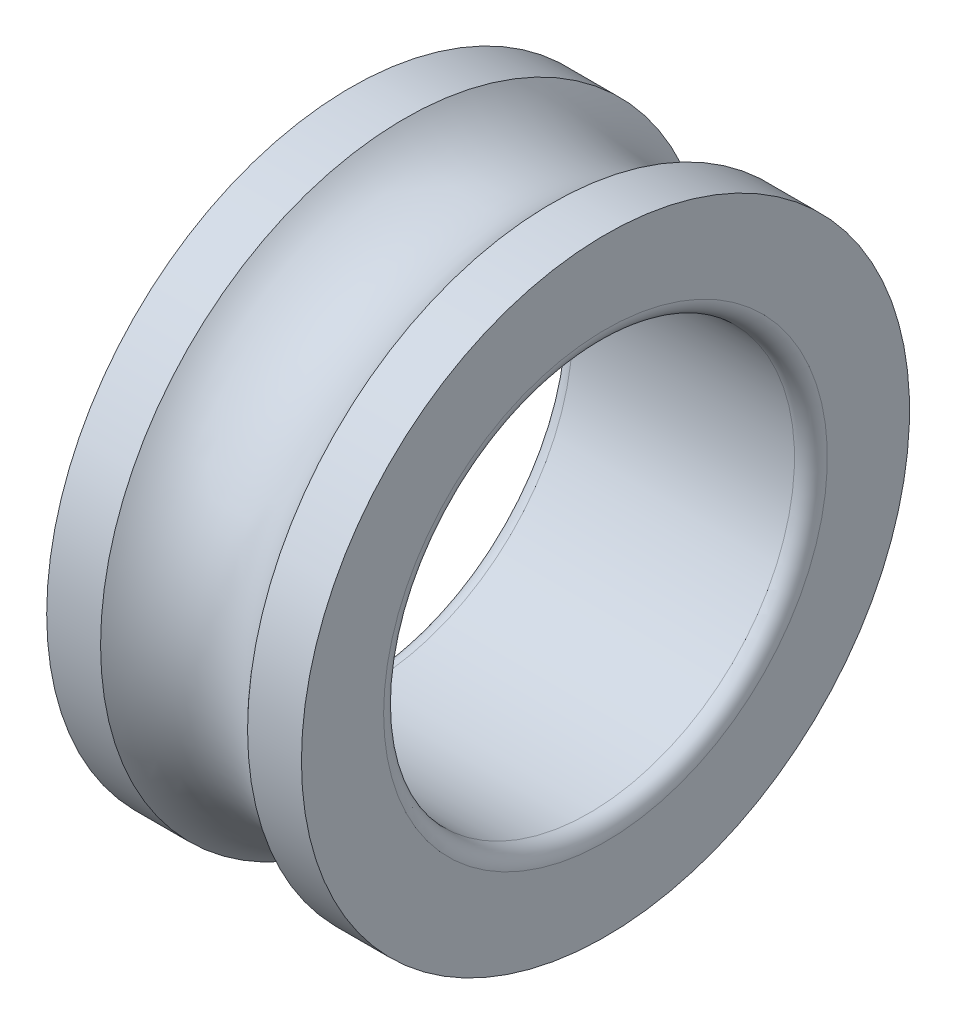
ISO-10303-21;
HEADER;
FILE_DESCRIPTION(('STEP AP214'),'2;1');
FILE_NAME('part.step','',(''),(''),'','','');
FILE_SCHEMA(('AUTOMOTIVE_DESIGN { 1 0 10303 214 1 1 1 1 }'));
ENDSEC;
DATA;
#1=APPLICATION_CONTEXT('core data for automotive mechanical design processes');
#2=APPLICATION_PROTOCOL_DEFINITION('international standard','automotive_design',2000,#1);
#3=PRODUCT_CONTEXT('',#1,'mechanical');
#4=PRODUCT('Part','Part','',(#3));
#5=PRODUCT_RELATED_PRODUCT_CATEGORY('part','',(#4));
#6=PRODUCT_DEFINITION_FORMATION('','',#4);
#7=PRODUCT_DEFINITION_CONTEXT('part definition',#1,'design');
#8=PRODUCT_DEFINITION('design','',#6,#7);
#9=PRODUCT_DEFINITION_SHAPE('','',#8);
#10=(LENGTH_UNIT() NAMED_UNIT(*) SI_UNIT(.MILLI.,.METRE.));
#11=(NAMED_UNIT(*) PLANE_ANGLE_UNIT() SI_UNIT($,.RADIAN.));
#12=(NAMED_UNIT(*) SI_UNIT($,.STERADIAN.) SOLID_ANGLE_UNIT());
#13=UNCERTAINTY_MEASURE_WITH_UNIT(LENGTH_MEASURE(1.E-05),#10,'distance_accuracy_value','');
#14=(GEOMETRIC_REPRESENTATION_CONTEXT(3) GLOBAL_UNCERTAINTY_ASSIGNED_CONTEXT((#13)) GLOBAL_UNIT_ASSIGNED_CONTEXT((#10,
#11,#12)) REPRESENTATION_CONTEXT('',''));
#15=CARTESIAN_POINT('',(0.,0.,0.));
#16=DIRECTION('',(0.,0.,1.));
#17=DIRECTION('',(1.,0.,0.));
#18=AXIS2_PLACEMENT_3D('',#15,#16,#17);
#19=CARTESIAN_POINT('',(-15.5,0.,0.));
#20=DIRECTION('',(-1.,0.,0.));
#21=DIRECTION('',(0.,0.,1.));
#22=AXIS2_PLACEMENT_3D('',#19,#20,#21);
#23=CYLINDRICAL_SURFACE('',#22,37.);
#24=CARTESIAN_POINT('',(-15.5,0.,0.));
#25=DIRECTION('',(-1.,0.,0.));
#26=DIRECTION('',(0.,0.,1.));
#27=AXIS2_PLACEMENT_3D('',#24,#25,#26);
#28=CIRCLE('',#27,37.);
#29=CARTESIAN_POINT('',(-15.5,0.,37.));
#30=VERTEX_POINT('',#29);
#31=EDGE_CURVE('E72',#30,#30,#28,.T.);
#32=ORIENTED_EDGE('',*,*,#31,.F.);
#33=EDGE_LOOP('',(#32));
#34=FACE_BOUND('',#33,.T.);
#35=CARTESIAN_POINT('',(-8.94427190999915,0.,0.));
#36=DIRECTION('',(-1.,0.,0.));
#37=DIRECTION('',(0.,0.,1.));
#38=AXIS2_PLACEMENT_3D('',#35,#36,#37);
#39=CIRCLE('',#38,37.);
#40=CARTESIAN_POINT('',(-8.94427190999915,0.,37.));
#41=VERTEX_POINT('',#40);
#42=EDGE_CURVE('E10',#41,#41,#39,.T.);
#43=ORIENTED_EDGE('',*,*,#42,.T.);
#44=EDGE_LOOP('',(#43));
#45=FACE_BOUND('',#44,.T.);
#46=ADVANCED_FACE('F37',(#34,#45),#23,.T.);
#47=CARTESIAN_POINT('',(0.,0.,0.));
#48=DIRECTION('',(-1.,0.,0.));
#49=DIRECTION('',(0.,0.,1.));
#50=AXIS2_PLACEMENT_3D('',#47,#48,#49);
#51=TOROIDAL_SURFACE('',#50,45.,12.);
#52=ORIENTED_EDGE('',*,*,#42,.F.);
#53=EDGE_LOOP('',(#52));
#54=FACE_BOUND('',#53,.T.);
#55=CARTESIAN_POINT('',(8.94427190999916,0.,0.));
#56=DIRECTION('',(-1.,0.,0.));
#57=DIRECTION('',(0.,0.,1.));
#58=AXIS2_PLACEMENT_3D('',#55,#56,#57);
#59=CIRCLE('',#58,37.);
#60=CARTESIAN_POINT('',(8.94427190999916,0.,37.));
#61=VERTEX_POINT('',#60);
#62=EDGE_CURVE('E44',#61,#61,#59,.T.);
#63=ORIENTED_EDGE('',*,*,#62,.T.);
#64=EDGE_LOOP('',(#63));
#65=FACE_BOUND('',#64,.T.);
#66=ADVANCED_FACE('F80',(#54,#65),#51,.F.);
#67=CARTESIAN_POINT('',(-15.5,0.,0.));
#68=DIRECTION('',(-1.,0.,0.));
#69=DIRECTION('',(0.,0.,1.));
#70=AXIS2_PLACEMENT_3D('',#67,#68,#69);
#71=CYLINDRICAL_SURFACE('',#70,37.);
#72=ORIENTED_EDGE('',*,*,#62,.F.);
#73=EDGE_LOOP('',(#72));
#74=FACE_BOUND('',#73,.T.);
#75=CARTESIAN_POINT('',(15.5,0.,0.));
#76=DIRECTION('',(-1.,0.,0.));
#77=DIRECTION('',(0.,0.,1.));
#78=AXIS2_PLACEMENT_3D('',#75,#76,#77);
#79=CIRCLE('',#78,37.);
#80=CARTESIAN_POINT('',(15.5,0.,37.));
#81=VERTEX_POINT('',#80);
#82=EDGE_CURVE('E49',#81,#81,#79,.T.);
#83=ORIENTED_EDGE('',*,*,#82,.T.);
#84=EDGE_LOOP('',(#83));
#85=FACE_BOUND('',#84,.T.);
#86=ADVANCED_FACE('F84',(#74,#85),#71,.T.);
#87=CARTESIAN_POINT('',(15.5,27.,0.));
#88=DIRECTION('',(-1.,0.,0.));
#89=DIRECTION('',(0.,0.,1.));
#90=AXIS2_PLACEMENT_3D('',#87,#88,#89);
#91=PLANE('',#90);
#92=ORIENTED_EDGE('',*,*,#82,.F.);
#93=EDGE_LOOP('',(#92));
#94=FACE_BOUND('',#93,.T.);
#95=CARTESIAN_POINT('',(15.5,0.,0.));
#96=DIRECTION('',(-1.,0.,0.));
#97=DIRECTION('',(0.,0.,1.));
#98=AXIS2_PLACEMENT_3D('',#95,#96,#97);
#99=CIRCLE('',#98,27.);
#100=CARTESIAN_POINT('',(15.5,0.,27.));
#101=VERTEX_POINT('',#100);
#102=EDGE_CURVE('E54',#101,#101,#99,.T.);
#103=ORIENTED_EDGE('',*,*,#102,.T.);
#104=EDGE_LOOP('',(#103));
#105=FACE_BOUND('',#104,.T.);
#106=ADVANCED_FACE('F89',(#94,#105),#91,.F.);
#107=CARTESIAN_POINT('',(13.5,0.,0.));
#108=DIRECTION('',(-1.,0.,0.));
#109=DIRECTION('',(0.,0.,1.));
#110=AXIS2_PLACEMENT_3D('',#107,#108,#109);
#111=TOROIDAL_SURFACE('',#110,27.,2.);
#112=ORIENTED_EDGE('',*,*,#102,.F.);
#113=EDGE_LOOP('',(#112));
#114=FACE_BOUND('',#113,.T.);
#115=CARTESIAN_POINT('',(13.5,0.,0.));
#116=DIRECTION('',(-1.,0.,0.));
#117=DIRECTION('',(0.,0.,1.));
#118=AXIS2_PLACEMENT_3D('',#115,#116,#117);
#119=CIRCLE('',#118,25.);
#120=CARTESIAN_POINT('',(13.5,0.,25.));
#121=VERTEX_POINT('',#120);
#122=EDGE_CURVE('E60',#121,#121,#119,.T.);
#123=ORIENTED_EDGE('',*,*,#122,.T.);
#124=EDGE_LOOP('',(#123));
#125=FACE_BOUND('',#124,.T.);
#126=ADVANCED_FACE('F95',(#114,#125),#111,.T.);
#127=CARTESIAN_POINT('',(-15.5,0.,0.));
#128=DIRECTION('',(-1.,0.,0.));
#129=DIRECTION('',(0.,0.,1.));
#130=AXIS2_PLACEMENT_3D('',#127,#128,#129);
#131=CYLINDRICAL_SURFACE('',#130,25.);
#132=ORIENTED_EDGE('',*,*,#122,.F.);
#133=EDGE_LOOP('',(#132));
#134=FACE_BOUND('',#133,.T.);
#135=CARTESIAN_POINT('',(-13.5,0.,0.));
#136=DIRECTION('',(-1.,0.,0.));
#137=DIRECTION('',(0.,0.,1.));
#138=AXIS2_PLACEMENT_3D('',#135,#136,#137);
#139=CIRCLE('',#138,25.);
#140=CARTESIAN_POINT('',(-13.5,0.,25.));
#141=VERTEX_POINT('',#140);
#142=EDGE_CURVE('E64',#141,#141,#139,.T.);
#143=ORIENTED_EDGE('',*,*,#142,.T.);
#144=EDGE_LOOP('',(#143));
#145=FACE_BOUND('',#144,.T.);
#146=ADVANCED_FACE('F99',(#134,#145),#131,.F.);
#147=CARTESIAN_POINT('',(-13.5,0.,0.));
#148=DIRECTION('',(-1.,0.,0.));
#149=DIRECTION('',(0.,0.,1.));
#150=AXIS2_PLACEMENT_3D('',#147,#148,#149);
#151=TOROIDAL_SURFACE('',#150,27.,2.);
#152=ORIENTED_EDGE('',*,*,#142,.F.);
#153=EDGE_LOOP('',(#152));
#154=FACE_BOUND('',#153,.T.);
#155=CARTESIAN_POINT('',(-15.5,0.,0.));
#156=DIRECTION('',(-1.,0.,0.));
#157=DIRECTION('',(0.,0.,1.));
#158=AXIS2_PLACEMENT_3D('',#155,#156,#157);
#159=CIRCLE('',#158,27.);
#160=CARTESIAN_POINT('',(-15.5,0.,27.));
#161=VERTEX_POINT('',#160);
#162=EDGE_CURVE('E68',#161,#161,#159,.T.);
#163=ORIENTED_EDGE('',*,*,#162,.T.);
#164=EDGE_LOOP('',(#163));
#165=FACE_BOUND('',#164,.T.);
#166=ADVANCED_FACE('F103',(#154,#165),#151,.T.);
#167=CARTESIAN_POINT('',(-15.5,27.,0.));
#168=DIRECTION('',(1.,0.,0.));
#169=DIRECTION('',(0.,0.,-1.));
#170=AXIS2_PLACEMENT_3D('',#167,#168,#169);
#171=PLANE('',#170);
#172=ORIENTED_EDGE('',*,*,#162,.F.);
#173=EDGE_LOOP('',(#172));
#174=FACE_BOUND('',#173,.T.);
#175=ORIENTED_EDGE('',*,*,#31,.T.);
#176=EDGE_LOOP('',(#175));
#177=FACE_BOUND('',#176,.T.);
#178=ADVANCED_FACE('F77',(#174,#177),#171,.F.);
#179=CLOSED_SHELL('',(#46,#66,#86,#106,#126,#146,#166,#178));
#180=MANIFOLD_SOLID_BREP('B2',#179);
#181=ADVANCED_BREP_SHAPE_REPRESENTATION('',(#18,#180),#14);
#182=SHAPE_DEFINITION_REPRESENTATION(#9,#181);
ENDSEC;
END-ISO-10303-21;
